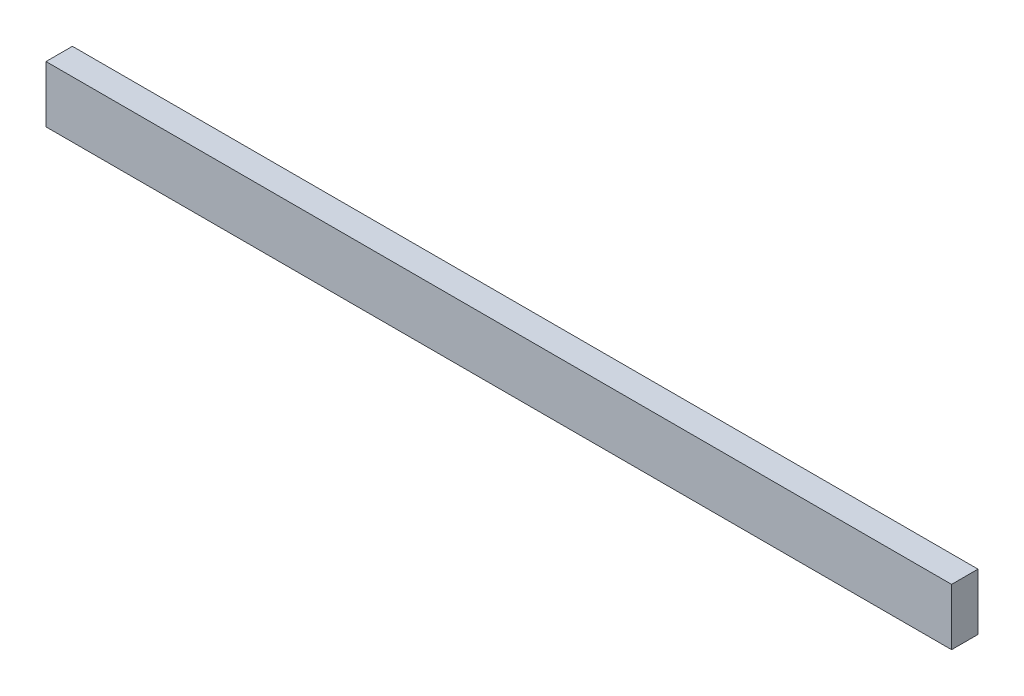
ISO-10303-21;
HEADER;
FILE_DESCRIPTION(('STEP AP214'),'2;1');
FILE_NAME('part.step','',(''),(''),'','','');
FILE_SCHEMA(('AUTOMOTIVE_DESIGN { 1 0 10303 214 1 1 1 1 }'));
ENDSEC;
DATA;
#1=APPLICATION_CONTEXT('core data for automotive mechanical design processes');
#2=APPLICATION_PROTOCOL_DEFINITION('international standard','automotive_design',2000,#1);
#3=PRODUCT_CONTEXT('',#1,'mechanical');
#4=PRODUCT('Part','Part','',(#3));
#5=PRODUCT_RELATED_PRODUCT_CATEGORY('part','',(#4));
#6=PRODUCT_DEFINITION_FORMATION('','',#4);
#7=PRODUCT_DEFINITION_CONTEXT('part definition',#1,'design');
#8=PRODUCT_DEFINITION('design','',#6,#7);
#9=PRODUCT_DEFINITION_SHAPE('','',#8);
#10=(LENGTH_UNIT() NAMED_UNIT(*) SI_UNIT(.MILLI.,.METRE.));
#11=(NAMED_UNIT(*) PLANE_ANGLE_UNIT() SI_UNIT($,.RADIAN.));
#12=(NAMED_UNIT(*) SI_UNIT($,.STERADIAN.) SOLID_ANGLE_UNIT());
#13=UNCERTAINTY_MEASURE_WITH_UNIT(LENGTH_MEASURE(1.E-05),#10,'distance_accuracy_value','');
#14=(GEOMETRIC_REPRESENTATION_CONTEXT(3) GLOBAL_UNCERTAINTY_ASSIGNED_CONTEXT((#13)) GLOBAL_UNIT_ASSIGNED_CONTEXT((#10,
#11,#12)) REPRESENTATION_CONTEXT('',''));
#15=CARTESIAN_POINT('',(0.,0.,0.));
#16=DIRECTION('',(0.,0.,1.));
#17=DIRECTION('',(1.,0.,0.));
#18=AXIS2_PLACEMENT_3D('',#15,#16,#17);
#19=CARTESIAN_POINT('',(-65.3525592008835,22.3863934762642,17.78));
#20=DIRECTION('',(1.,0.,0.));
#21=DIRECTION('',(0.,0.,-1.));
#22=AXIS2_PLACEMENT_3D('',#19,#20,#21);
#23=PLANE('',#22);
#24=DIRECTION('',(0.,-1.,0.));
#25=VECTOR('',#24,1.);
#26=CARTESIAN_POINT('',(-65.3525592008835,22.3863934762642,0.));
#27=LINE('',#26,#25);
#28=CARTESIAN_POINT('',(-65.3525592008835,22.3863934762642,0.));
#29=VERTEX_POINT('',#28);
#30=CARTESIAN_POINT('',(-65.3525592008835,-15.7136065237358,0.));
#31=VERTEX_POINT('',#30);
#32=EDGE_CURVE('E94',#29,#31,#27,.T.);
#33=ORIENTED_EDGE('',*,*,#32,.T.);
#34=DIRECTION('',(0.,0.,-1.));
#35=VECTOR('',#34,1.);
#36=CARTESIAN_POINT('',(-65.3525592008835,-15.7136065237358,17.78));
#37=LINE('',#36,#35);
#38=CARTESIAN_POINT('',(-65.3525592008835,-15.7136065237358,17.78));
#39=VERTEX_POINT('',#38);
#40=EDGE_CURVE('E11',#39,#31,#37,.T.);
#41=ORIENTED_EDGE('',*,*,#40,.F.);
#42=DIRECTION('',(0.,-1.,0.));
#43=VECTOR('',#42,1.);
#44=CARTESIAN_POINT('',(-65.3525592008835,22.3863934762642,17.78));
#45=LINE('',#44,#43);
#46=CARTESIAN_POINT('',(-65.3525592008835,22.3863934762642,17.78));
#47=VERTEX_POINT('',#46);
#48=EDGE_CURVE('E82',#47,#39,#45,.T.);
#49=ORIENTED_EDGE('',*,*,#48,.F.);
#50=DIRECTION('',(0.,0.,-1.));
#51=VECTOR('',#50,1.);
#52=CARTESIAN_POINT('',(-65.3525592008835,22.3863934762642,17.78));
#53=LINE('',#52,#51);
#54=EDGE_CURVE('E90',#47,#29,#53,.T.);
#55=ORIENTED_EDGE('',*,*,#54,.T.);
#56=EDGE_LOOP('',(#33,#41,#49,#55));
#57=FACE_BOUND('',#56,.T.);
#58=ADVANCED_FACE('F31',(#57),#23,.F.);
#59=CARTESIAN_POINT('',(-65.3525592008835,-15.7136065237358,17.78));
#60=DIRECTION('',(0.,1.,0.));
#61=DIRECTION('',(0.,0.,1.));
#62=AXIS2_PLACEMENT_3D('',#59,#60,#61);
#63=PLANE('',#62);
#64=DIRECTION('',(1.,0.,0.));
#65=VECTOR('',#64,1.);
#66=CARTESIAN_POINT('',(-65.3525592008835,-15.7136065237358,0.));
#67=LINE('',#66,#65);
#68=CARTESIAN_POINT('',(544.247440799116,-15.7136065237358,0.));
#69=VERTEX_POINT('',#68);
#70=EDGE_CURVE('E86',#31,#69,#67,.T.);
#71=ORIENTED_EDGE('',*,*,#70,.T.);
#72=DIRECTION('',(0.,0.,-1.));
#73=VECTOR('',#72,1.);
#74=CARTESIAN_POINT('',(544.247440799116,-15.7136065237358,17.78));
#75=LINE('',#74,#73);
#76=CARTESIAN_POINT('',(544.247440799116,-15.7136065237358,17.78));
#77=VERTEX_POINT('',#76);
#78=EDGE_CURVE('E39',#77,#69,#75,.T.);
#79=ORIENTED_EDGE('',*,*,#78,.F.);
#80=DIRECTION('',(1.,0.,0.));
#81=VECTOR('',#80,1.);
#82=CARTESIAN_POINT('',(-65.3525592008835,-15.7136065237358,17.78));
#83=LINE('',#82,#81);
#84=EDGE_CURVE('E77',#39,#77,#83,.T.);
#85=ORIENTED_EDGE('',*,*,#84,.F.);
#86=ORIENTED_EDGE('',*,*,#40,.T.);
#87=EDGE_LOOP('',(#71,#79,#85,#86));
#88=FACE_BOUND('',#87,.T.);
#89=ADVANCED_FACE('F85',(#88),#63,.F.);
#90=CARTESIAN_POINT('',(544.247440799116,22.3863934762642,17.78));
#91=DIRECTION('',(-1.,0.,0.));
#92=DIRECTION('',(0.,0.,1.));
#93=AXIS2_PLACEMENT_3D('',#90,#91,#92);
#94=PLANE('',#93);
#95=DIRECTION('',(0.,1.,0.));
#96=VECTOR('',#95,1.);
#97=CARTESIAN_POINT('',(544.247440799116,22.3863934762642,0.));
#98=LINE('',#97,#96);
#99=CARTESIAN_POINT('',(544.247440799116,22.3863934762642,0.));
#100=VERTEX_POINT('',#99);
#101=EDGE_CURVE('E64',#69,#100,#98,.T.);
#102=ORIENTED_EDGE('',*,*,#101,.T.);
#103=DIRECTION('',(0.,0.,-1.));
#104=VECTOR('',#103,1.);
#105=CARTESIAN_POINT('',(544.247440799116,22.3863934762642,17.78));
#106=LINE('',#105,#104);
#107=CARTESIAN_POINT('',(544.247440799116,22.3863934762642,17.78));
#108=VERTEX_POINT('',#107);
#109=EDGE_CURVE('E87',#108,#100,#106,.T.);
#110=ORIENTED_EDGE('',*,*,#109,.F.);
#111=DIRECTION('',(0.,1.,0.));
#112=VECTOR('',#111,1.);
#113=CARTESIAN_POINT('',(544.247440799116,22.3863934762642,17.78));
#114=LINE('',#113,#112);
#115=EDGE_CURVE('E80',#77,#108,#114,.T.);
#116=ORIENTED_EDGE('',*,*,#115,.F.);
#117=ORIENTED_EDGE('',*,*,#78,.T.);
#118=EDGE_LOOP('',(#102,#110,#116,#117));
#119=FACE_BOUND('',#118,.T.);
#120=ADVANCED_FACE('F88',(#119),#94,.F.);
#121=CARTESIAN_POINT('',(-65.3525592008835,22.3863934762642,17.78));
#122=DIRECTION('',(0.,-1.,0.));
#123=DIRECTION('',(0.,0.,-1.));
#124=AXIS2_PLACEMENT_3D('',#121,#122,#123);
#125=PLANE('',#124);
#126=DIRECTION('',(-1.,0.,0.));
#127=VECTOR('',#126,1.);
#128=CARTESIAN_POINT('',(-65.3525592008835,22.3863934762642,0.));
#129=LINE('',#128,#127);
#130=EDGE_CURVE('E70',#100,#29,#129,.T.);
#131=ORIENTED_EDGE('',*,*,#130,.T.);
#132=ORIENTED_EDGE('',*,*,#54,.F.);
#133=DIRECTION('',(-1.,0.,0.));
#134=VECTOR('',#133,1.);
#135=CARTESIAN_POINT('',(-65.3525592008835,22.3863934762642,17.78));
#136=LINE('',#135,#134);
#137=EDGE_CURVE('E47',#108,#47,#136,.T.);
#138=ORIENTED_EDGE('',*,*,#137,.F.);
#139=ORIENTED_EDGE('',*,*,#109,.T.);
#140=EDGE_LOOP('',(#131,#132,#138,#139));
#141=FACE_BOUND('',#140,.T.);
#142=ADVANCED_FACE('F101',(#141),#125,.F.);
#143=CARTESIAN_POINT('',(-65.3525592008835,-15.7136065237358,17.78));
#144=DIRECTION('',(0.,0.,1.));
#145=DIRECTION('',(1.,0.,0.));
#146=AXIS2_PLACEMENT_3D('',#143,#144,#145);
#147=PLANE('',#146);
#148=ORIENTED_EDGE('',*,*,#48,.T.);
#149=ORIENTED_EDGE('',*,*,#84,.T.);
#150=ORIENTED_EDGE('',*,*,#115,.T.);
#151=ORIENTED_EDGE('',*,*,#137,.T.);
#152=EDGE_LOOP('',(#148,#149,#150,#151));
#153=FACE_BOUND('',#152,.T.);
#154=ADVANCED_FACE('F78',(#153),#147,.T.);
#155=CARTESIAN_POINT('',(-65.3525592008835,-15.7136065237358,0.));
#156=DIRECTION('',(0.,0.,1.));
#157=DIRECTION('',(1.,0.,0.));
#158=AXIS2_PLACEMENT_3D('',#155,#156,#157);
#159=PLANE('',#158);
#160=ORIENTED_EDGE('',*,*,#32,.F.);
#161=ORIENTED_EDGE('',*,*,#130,.F.);
#162=ORIENTED_EDGE('',*,*,#101,.F.);
#163=ORIENTED_EDGE('',*,*,#70,.F.);
#164=EDGE_LOOP('',(#160,#161,#162,#163));
#165=FACE_BOUND('',#164,.T.);
#166=ADVANCED_FACE('F104',(#165),#159,.F.);
#167=CLOSED_SHELL('',(#58,#89,#120,#142,#154,#166));
#168=MANIFOLD_SOLID_BREP('B2',#167);
#169=ADVANCED_BREP_SHAPE_REPRESENTATION('',(#18,#168),#14);
#170=SHAPE_DEFINITION_REPRESENTATION(#9,#169);
ENDSEC;
END-ISO-10303-21;
